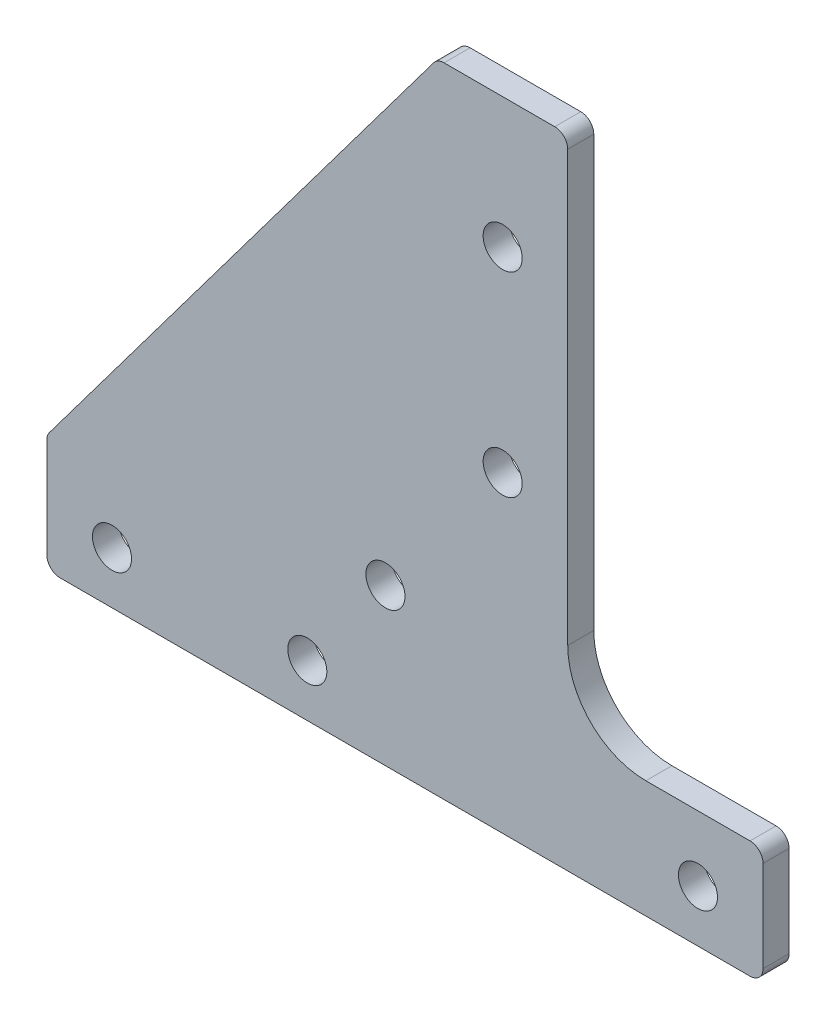
ISO-10303-21;
HEADER;
FILE_DESCRIPTION(('STEP AP214'),'2;1');
FILE_NAME('part.step','',(''),(''),'','','');
FILE_SCHEMA(('AUTOMOTIVE_DESIGN { 1 0 10303 214 1 1 1 1 }'));
ENDSEC;
DATA;
#1=APPLICATION_CONTEXT('core data for automotive mechanical design processes');
#2=APPLICATION_PROTOCOL_DEFINITION('international standard','automotive_design',2000,#1);
#3=PRODUCT_CONTEXT('',#1,'mechanical');
#4=PRODUCT('Part','Part','',(#3));
#5=PRODUCT_RELATED_PRODUCT_CATEGORY('part','',(#4));
#6=PRODUCT_DEFINITION_FORMATION('','',#4);
#7=PRODUCT_DEFINITION_CONTEXT('part definition',#1,'design');
#8=PRODUCT_DEFINITION('design','',#6,#7);
#9=PRODUCT_DEFINITION_SHAPE('','',#8);
#10=(LENGTH_UNIT() NAMED_UNIT(*) SI_UNIT(.MILLI.,.METRE.));
#11=(NAMED_UNIT(*) PLANE_ANGLE_UNIT() SI_UNIT($,.RADIAN.));
#12=(NAMED_UNIT(*) SI_UNIT($,.STERADIAN.) SOLID_ANGLE_UNIT());
#13=UNCERTAINTY_MEASURE_WITH_UNIT(LENGTH_MEASURE(1.E-05),#10,'distance_accuracy_value','');
#14=(GEOMETRIC_REPRESENTATION_CONTEXT(3) GLOBAL_UNCERTAINTY_ASSIGNED_CONTEXT((#13)) GLOBAL_UNIT_ASSIGNED_CONTEXT((#10,
#11,#12)) REPRESENTATION_CONTEXT('',''));
#15=CARTESIAN_POINT('',(0.,0.,0.));
#16=DIRECTION('',(0.,0.,1.));
#17=DIRECTION('',(1.,0.,0.));
#18=AXIS2_PLACEMENT_3D('',#15,#16,#17);
#19=CARTESIAN_POINT('',(20.,0.,2.));
#20=DIRECTION('',(1.,0.,0.));
#21=DIRECTION('',(0.,0.,-1.));
#22=AXIS2_PLACEMENT_3D('',#19,#20,#21);
#23=PLANE('',#22);
#24=DIRECTION('',(0.,-1.,0.));
#25=VECTOR('',#24,1.);
#26=CARTESIAN_POINT('',(20.,0.,0.));
#27=LINE('',#26,#25);
#28=CARTESIAN_POINT('',(20.,4.,0.));
#29=VERTEX_POINT('',#28);
#30=CARTESIAN_POINT('',(20.,-3.,0.));
#31=VERTEX_POINT('',#30);
#32=EDGE_CURVE('E225',#29,#31,#27,.T.);
#33=ORIENTED_EDGE('',*,*,#32,.F.);
#34=DIRECTION('',(0.,0.,-1.));
#35=VECTOR('',#34,1.);
#36=CARTESIAN_POINT('',(20.,4.,2.));
#37=LINE('',#36,#35);
#38=CARTESIAN_POINT('',(20.,4.,2.));
#39=VERTEX_POINT('',#38);
#40=EDGE_CURVE('E63',#29,#39,#37,.F.);
#41=ORIENTED_EDGE('',*,*,#40,.T.);
#42=DIRECTION('',(0.,-1.,0.));
#43=VECTOR('',#42,1.);
#44=CARTESIAN_POINT('',(20.,0.,2.));
#45=LINE('',#44,#43);
#46=CARTESIAN_POINT('',(20.,-3.,2.));
#47=VERTEX_POINT('',#46);
#48=EDGE_CURVE('E194',#39,#47,#45,.T.);
#49=ORIENTED_EDGE('',*,*,#48,.T.);
#50=DIRECTION('',(0.,0.,-1.));
#51=VECTOR('',#50,1.);
#52=CARTESIAN_POINT('',(20.,-3.,0.));
#53=LINE('',#52,#51);
#54=EDGE_CURVE('E281',#47,#31,#53,.T.);
#55=ORIENTED_EDGE('',*,*,#54,.T.);
#56=EDGE_LOOP('',(#33,#41,#49,#55));
#57=FACE_BOUND('',#56,.T.);
#58=ADVANCED_FACE('F41',(#57),#23,.T.);
#59=CARTESIAN_POINT('',(0.,44.9999999999999,2.));
#60=DIRECTION('',(0.,1.,0.));
#61=DIRECTION('',(0.,0.,1.));
#62=AXIS2_PLACEMENT_3D('',#59,#60,#61);
#63=PLANE('',#62);
#64=DIRECTION('',(1.,0.,0.));
#65=VECTOR('',#64,1.);
#66=CARTESIAN_POINT('',(0.,44.9999999999999,0.));
#67=LINE('',#66,#65);
#68=CARTESIAN_POINT('',(-4.50000000000001,44.9999999999999,0.));
#69=VERTEX_POINT('',#68);
#70=CARTESIAN_POINT('',(4.,44.9999999999999,0.));
#71=VERTEX_POINT('',#70);
#72=EDGE_CURVE('E228',#69,#71,#67,.T.);
#73=ORIENTED_EDGE('',*,*,#72,.F.);
#74=DIRECTION('',(0.,0.,-1.));
#75=VECTOR('',#74,1.);
#76=CARTESIAN_POINT('',(-4.50000000000001,44.9999999999999,2.));
#77=LINE('',#76,#75);
#78=CARTESIAN_POINT('',(-4.50000000000001,44.9999999999999,2.));
#79=VERTEX_POINT('',#78);
#80=EDGE_CURVE('E264',#69,#79,#77,.F.);
#81=ORIENTED_EDGE('',*,*,#80,.T.);
#82=DIRECTION('',(1.,0.,0.));
#83=VECTOR('',#82,1.);
#84=CARTESIAN_POINT('',(0.,44.9999999999999,2.));
#85=LINE('',#84,#83);
#86=CARTESIAN_POINT('',(4.,44.9999999999999,2.));
#87=VERTEX_POINT('',#86);
#88=EDGE_CURVE('E196',#79,#87,#85,.T.);
#89=ORIENTED_EDGE('',*,*,#88,.T.);
#90=DIRECTION('',(0.,0.,-1.));
#91=VECTOR('',#90,1.);
#92=CARTESIAN_POINT('',(4.,44.9999999999999,0.));
#93=LINE('',#92,#91);
#94=EDGE_CURVE('E261',#87,#71,#93,.T.);
#95=ORIENTED_EDGE('',*,*,#94,.T.);
#96=EDGE_LOOP('',(#73,#81,#89,#95));
#97=FACE_BOUND('',#96,.T.);
#98=ADVANCED_FACE('F322',(#97),#63,.T.);
#99=CARTESIAN_POINT('',(-24.8,18.6,2.));
#100=DIRECTION('',(-0.799999999999999,0.600000000000001,0.));
#101=DIRECTION('',(-0.600000000000001,-0.799999999999999,0.));
#102=AXIS2_PLACEMENT_3D('',#99,#100,#101);
#103=PLANE('',#102);
#104=DIRECTION('',(0.600000000000001,0.799999999999999,0.));
#105=VECTOR('',#104,1.);
#106=CARTESIAN_POINT('',(-24.8,18.6,2.));
#107=LINE('',#106,#105);
#108=CARTESIAN_POINT('',(-34.8,5.26666666666668,2.));
#109=VERTEX_POINT('',#108);
#110=CARTESIAN_POINT('',(-5.3,44.5999999999999,2.));
#111=VERTEX_POINT('',#110);
#112=EDGE_CURVE('E199',#109,#111,#107,.T.);
#113=ORIENTED_EDGE('',*,*,#112,.T.);
#114=DIRECTION('',(0.,0.,-1.));
#115=VECTOR('',#114,1.);
#116=CARTESIAN_POINT('',(-5.3,44.5999999999999,2.));
#117=LINE('',#116,#115);
#118=CARTESIAN_POINT('',(-5.3,44.5999999999999,0.));
#119=VERTEX_POINT('',#118);
#120=EDGE_CURVE('E246',#111,#119,#117,.T.);
#121=ORIENTED_EDGE('',*,*,#120,.T.);
#122=DIRECTION('',(0.600000000000001,0.799999999999999,0.));
#123=VECTOR('',#122,1.);
#124=CARTESIAN_POINT('',(-24.8,18.6,0.));
#125=LINE('',#124,#123);
#126=CARTESIAN_POINT('',(-34.8,5.26666666666668,0.));
#127=VERTEX_POINT('',#126);
#128=EDGE_CURVE('E231',#127,#119,#125,.T.);
#129=ORIENTED_EDGE('',*,*,#128,.F.);
#130=DIRECTION('',(0.,0.,-1.));
#131=VECTOR('',#130,1.);
#132=CARTESIAN_POINT('',(-34.8,5.26666666666668,2.));
#133=LINE('',#132,#131);
#134=EDGE_CURVE('E244',#127,#109,#133,.F.);
#135=ORIENTED_EDGE('',*,*,#134,.T.);
#136=EDGE_LOOP('',(#113,#121,#129,#135));
#137=FACE_BOUND('',#136,.T.);
#138=ADVANCED_FACE('F328',(#137),#103,.T.);
#139=CARTESIAN_POINT('',(-35.,0.,2.));
#140=DIRECTION('',(-1.,0.,0.));
#141=DIRECTION('',(0.,0.,1.));
#142=AXIS2_PLACEMENT_3D('',#139,#140,#141);
#143=PLANE('',#142);
#144=DIRECTION('',(0.,1.,0.));
#145=VECTOR('',#144,1.);
#146=CARTESIAN_POINT('',(-35.,0.,2.));
#147=LINE('',#146,#145);
#148=CARTESIAN_POINT('',(-35.,-3.,2.));
#149=VERTEX_POINT('',#148);
#150=CARTESIAN_POINT('',(-35.,4.66666666666668,2.));
#151=VERTEX_POINT('',#150);
#152=EDGE_CURVE('E202',#149,#151,#147,.T.);
#153=ORIENTED_EDGE('',*,*,#152,.T.);
#154=DIRECTION('',(0.,0.,-1.));
#155=VECTOR('',#154,1.);
#156=CARTESIAN_POINT('',(-35.,4.66666666666668,2.));
#157=LINE('',#156,#155);
#158=CARTESIAN_POINT('',(-35.,4.66666666666668,0.));
#159=VERTEX_POINT('',#158);
#160=EDGE_CURVE('E11',#151,#159,#157,.T.);
#161=ORIENTED_EDGE('',*,*,#160,.T.);
#162=DIRECTION('',(0.,1.,0.));
#163=VECTOR('',#162,1.);
#164=CARTESIAN_POINT('',(-35.,0.,0.));
#165=LINE('',#164,#163);
#166=CARTESIAN_POINT('',(-35.,-3.,0.));
#167=VERTEX_POINT('',#166);
#168=EDGE_CURVE('E234',#167,#159,#165,.T.);
#169=ORIENTED_EDGE('',*,*,#168,.F.);
#170=DIRECTION('',(0.,0.,-1.));
#171=VECTOR('',#170,1.);
#172=CARTESIAN_POINT('',(-35.,-3.,2.));
#173=LINE('',#172,#171);
#174=EDGE_CURVE('E49',#167,#149,#173,.F.);
#175=ORIENTED_EDGE('',*,*,#174,.T.);
#176=EDGE_LOOP('',(#153,#161,#169,#175));
#177=FACE_BOUND('',#176,.T.);
#178=ADVANCED_FACE('F293',(#177),#143,.T.);
#179=CARTESIAN_POINT('',(-30.,0.,2.));
#180=DIRECTION('',(0.,0.,-1.));
#181=DIRECTION('',(-1.,0.,0.));
#182=AXIS2_PLACEMENT_3D('',#179,#180,#181);
#183=CYLINDRICAL_SURFACE('',#182,1.5);
#184=CARTESIAN_POINT('',(-30.,0.,2.));
#185=DIRECTION('',(0.,0.,1.));
#186=DIRECTION('',(1.,0.,0.));
#187=AXIS2_PLACEMENT_3D('',#184,#185,#186);
#188=CIRCLE('',#187,1.5);
#189=CARTESIAN_POINT('',(-28.5,0.,2.));
#190=VERTEX_POINT('',#189);
#191=EDGE_CURVE('E191',#190,#190,#188,.T.);
#192=ORIENTED_EDGE('',*,*,#191,.T.);
#193=EDGE_LOOP('',(#192));
#194=FACE_BOUND('',#193,.T.);
#195=CARTESIAN_POINT('',(-30.,0.,0.));
#196=DIRECTION('',(0.,0.,1.));
#197=DIRECTION('',(1.,0.,0.));
#198=AXIS2_PLACEMENT_3D('',#195,#196,#197);
#199=CIRCLE('',#198,1.5);
#200=CARTESIAN_POINT('',(-28.5,0.,0.));
#201=VERTEX_POINT('',#200);
#202=EDGE_CURVE('E222',#201,#201,#199,.T.);
#203=ORIENTED_EDGE('',*,*,#202,.F.);
#204=EDGE_LOOP('',(#203));
#205=FACE_BOUND('',#204,.T.);
#206=ADVANCED_FACE('F347',(#194,#205),#183,.F.);
#207=CARTESIAN_POINT('',(0.,35.,2.));
#208=DIRECTION('',(0.,0.,-1.));
#209=DIRECTION('',(-1.,0.,0.));
#210=AXIS2_PLACEMENT_3D('',#207,#208,#209);
#211=CYLINDRICAL_SURFACE('',#210,1.5);
#212=CARTESIAN_POINT('',(0.,35.,2.));
#213=DIRECTION('',(0.,0.,1.));
#214=DIRECTION('',(1.,0.,0.));
#215=AXIS2_PLACEMENT_3D('',#212,#213,#214);
#216=CIRCLE('',#215,1.5);
#217=CARTESIAN_POINT('',(1.5,35.,2.));
#218=VERTEX_POINT('',#217);
#219=EDGE_CURVE('E188',#218,#218,#216,.T.);
#220=ORIENTED_EDGE('',*,*,#219,.T.);
#221=EDGE_LOOP('',(#220));
#222=FACE_BOUND('',#221,.T.);
#223=CARTESIAN_POINT('',(0.,35.,0.));
#224=DIRECTION('',(0.,0.,1.));
#225=DIRECTION('',(1.,0.,0.));
#226=AXIS2_PLACEMENT_3D('',#223,#224,#225);
#227=CIRCLE('',#226,1.5);
#228=CARTESIAN_POINT('',(1.5,35.,0.));
#229=VERTEX_POINT('',#228);
#230=EDGE_CURVE('E219',#229,#229,#227,.T.);
#231=ORIENTED_EDGE('',*,*,#230,.F.);
#232=EDGE_LOOP('',(#231));
#233=FACE_BOUND('',#232,.T.);
#234=ADVANCED_FACE('F350',(#222,#233),#211,.F.);
#235=CARTESIAN_POINT('',(-15.,0.,2.));
#236=DIRECTION('',(0.,0.,-1.));
#237=DIRECTION('',(-1.,0.,0.));
#238=AXIS2_PLACEMENT_3D('',#235,#236,#237);
#239=CYLINDRICAL_SURFACE('',#238,1.5);
#240=CARTESIAN_POINT('',(-15.,0.,2.));
#241=DIRECTION('',(0.,0.,1.));
#242=DIRECTION('',(1.,0.,0.));
#243=AXIS2_PLACEMENT_3D('',#240,#241,#242);
#244=CIRCLE('',#243,1.5);
#245=CARTESIAN_POINT('',(-13.5,0.,2.));
#246=VERTEX_POINT('',#245);
#247=EDGE_CURVE('E185',#246,#246,#244,.T.);
#248=ORIENTED_EDGE('',*,*,#247,.T.);
#249=EDGE_LOOP('',(#248));
#250=FACE_BOUND('',#249,.T.);
#251=CARTESIAN_POINT('',(-15.,0.,0.));
#252=DIRECTION('',(0.,0.,1.));
#253=DIRECTION('',(1.,0.,0.));
#254=AXIS2_PLACEMENT_3D('',#251,#252,#253);
#255=CIRCLE('',#254,1.5);
#256=CARTESIAN_POINT('',(-13.5,0.,0.));
#257=VERTEX_POINT('',#256);
#258=EDGE_CURVE('E216',#257,#257,#255,.T.);
#259=ORIENTED_EDGE('',*,*,#258,.F.);
#260=EDGE_LOOP('',(#259));
#261=FACE_BOUND('',#260,.T.);
#262=ADVANCED_FACE('F354',(#250,#261),#239,.F.);
#263=CARTESIAN_POINT('',(0.,20.,2.));
#264=DIRECTION('',(0.,0.,-1.));
#265=DIRECTION('',(-1.,0.,0.));
#266=AXIS2_PLACEMENT_3D('',#263,#264,#265);
#267=CYLINDRICAL_SURFACE('',#266,1.5);
#268=CARTESIAN_POINT('',(0.,20.,2.));
#269=DIRECTION('',(0.,0.,1.));
#270=DIRECTION('',(1.,0.,0.));
#271=AXIS2_PLACEMENT_3D('',#268,#269,#270);
#272=CIRCLE('',#271,1.5);
#273=CARTESIAN_POINT('',(1.5,20.,2.));
#274=VERTEX_POINT('',#273);
#275=EDGE_CURVE('E182',#274,#274,#272,.T.);
#276=ORIENTED_EDGE('',*,*,#275,.T.);
#277=EDGE_LOOP('',(#276));
#278=FACE_BOUND('',#277,.T.);
#279=CARTESIAN_POINT('',(0.,20.,0.));
#280=DIRECTION('',(0.,0.,1.));
#281=DIRECTION('',(1.,0.,0.));
#282=AXIS2_PLACEMENT_3D('',#279,#280,#281);
#283=CIRCLE('',#282,1.5);
#284=CARTESIAN_POINT('',(1.5,20.,0.));
#285=VERTEX_POINT('',#284);
#286=EDGE_CURVE('E213',#285,#285,#283,.T.);
#287=ORIENTED_EDGE('',*,*,#286,.F.);
#288=EDGE_LOOP('',(#287));
#289=FACE_BOUND('',#288,.T.);
#290=ADVANCED_FACE('F358',(#278,#289),#267,.F.);
#291=CARTESIAN_POINT('',(-8.99999999999999,8.00000000000001,2.));
#292=DIRECTION('',(0.,0.,-1.));
#293=DIRECTION('',(-1.,0.,0.));
#294=AXIS2_PLACEMENT_3D('',#291,#292,#293);
#295=CYLINDRICAL_SURFACE('',#294,1.5);
#296=CARTESIAN_POINT('',(-8.99999999999999,8.00000000000001,2.));
#297=DIRECTION('',(0.,0.,1.));
#298=DIRECTION('',(1.,0.,0.));
#299=AXIS2_PLACEMENT_3D('',#296,#297,#298);
#300=CIRCLE('',#299,1.5);
#301=CARTESIAN_POINT('',(-7.49999999999999,8.00000000000001,2.));
#302=VERTEX_POINT('',#301);
#303=EDGE_CURVE('E178',#302,#302,#300,.T.);
#304=ORIENTED_EDGE('',*,*,#303,.T.);
#305=EDGE_LOOP('',(#304));
#306=FACE_BOUND('',#305,.T.);
#307=CARTESIAN_POINT('',(-8.99999999999999,8.00000000000001,0.));
#308=DIRECTION('',(0.,0.,1.));
#309=DIRECTION('',(1.,0.,0.));
#310=AXIS2_PLACEMENT_3D('',#307,#308,#309);
#311=CIRCLE('',#310,1.5);
#312=CARTESIAN_POINT('',(-7.49999999999999,8.00000000000001,0.));
#313=VERTEX_POINT('',#312);
#314=EDGE_CURVE('E210',#313,#313,#311,.T.);
#315=ORIENTED_EDGE('',*,*,#314,.F.);
#316=EDGE_LOOP('',(#315));
#317=FACE_BOUND('',#316,.T.);
#318=ADVANCED_FACE('F362',(#306,#317),#295,.F.);
#319=CARTESIAN_POINT('',(15.,0.,2.));
#320=DIRECTION('',(0.,0.,-1.));
#321=DIRECTION('',(-1.,0.,0.));
#322=AXIS2_PLACEMENT_3D('',#319,#320,#321);
#323=CYLINDRICAL_SURFACE('',#322,1.5);
#324=CARTESIAN_POINT('',(15.,0.,2.));
#325=DIRECTION('',(0.,0.,1.));
#326=DIRECTION('',(1.,0.,0.));
#327=AXIS2_PLACEMENT_3D('',#324,#325,#326);
#328=CIRCLE('',#327,1.5);
#329=CARTESIAN_POINT('',(16.5,0.,2.));
#330=VERTEX_POINT('',#329);
#331=EDGE_CURVE('E175',#330,#330,#328,.T.);
#332=ORIENTED_EDGE('',*,*,#331,.T.);
#333=EDGE_LOOP('',(#332));
#334=FACE_BOUND('',#333,.T.);
#335=CARTESIAN_POINT('',(15.,0.,0.));
#336=DIRECTION('',(0.,0.,1.));
#337=DIRECTION('',(1.,0.,0.));
#338=AXIS2_PLACEMENT_3D('',#335,#336,#337);
#339=CIRCLE('',#338,1.5);
#340=CARTESIAN_POINT('',(16.5,0.,0.));
#341=VERTEX_POINT('',#340);
#342=EDGE_CURVE('E173',#341,#341,#339,.T.);
#343=ORIENTED_EDGE('',*,*,#342,.F.);
#344=EDGE_LOOP('',(#343));
#345=FACE_BOUND('',#344,.T.);
#346=ADVANCED_FACE('F366',(#334,#345),#323,.F.);
#347=CARTESIAN_POINT('',(0.,-4.,2.));
#348=DIRECTION('',(0.,1.,0.));
#349=DIRECTION('',(-1.,0.,0.));
#350=AXIS2_PLACEMENT_3D('',#347,#348,#349);
#351=PLANE('',#350);
#352=DIRECTION('',(1.,0.,0.));
#353=VECTOR('',#352,1.);
#354=CARTESIAN_POINT('',(0.,-4.,0.));
#355=LINE('',#354,#353);
#356=CARTESIAN_POINT('',(-34.,-4.,0.));
#357=VERTEX_POINT('',#356);
#358=CARTESIAN_POINT('',(19.,-4.,0.));
#359=VERTEX_POINT('',#358);
#360=EDGE_CURVE('E179',#357,#359,#355,.T.);
#361=ORIENTED_EDGE('',*,*,#360,.T.);
#362=DIRECTION('',(0.,0.,-1.));
#363=VECTOR('',#362,1.);
#364=CARTESIAN_POINT('',(19.,-4.,2.));
#365=LINE('',#364,#363);
#366=CARTESIAN_POINT('',(19.,-4.,2.));
#367=VERTEX_POINT('',#366);
#368=EDGE_CURVE('E288',#359,#367,#365,.F.);
#369=ORIENTED_EDGE('',*,*,#368,.T.);
#370=DIRECTION('',(1.,0.,0.));
#371=VECTOR('',#370,1.);
#372=CARTESIAN_POINT('',(0.,-4.,2.));
#373=LINE('',#372,#371);
#374=CARTESIAN_POINT('',(-34.,-4.,2.));
#375=VERTEX_POINT('',#374);
#376=EDGE_CURVE('E205',#375,#367,#373,.T.);
#377=ORIENTED_EDGE('',*,*,#376,.F.);
#378=DIRECTION('',(0.,0.,-1.));
#379=VECTOR('',#378,1.);
#380=CARTESIAN_POINT('',(-34.,-4.,0.));
#381=LINE('',#380,#379);
#382=EDGE_CURVE('E285',#375,#357,#381,.T.);
#383=ORIENTED_EDGE('',*,*,#382,.T.);
#384=EDGE_LOOP('',(#361,#369,#377,#383));
#385=FACE_BOUND('',#384,.T.);
#386=ADVANCED_FACE('F303',(#385),#351,.F.);
#387=CARTESIAN_POINT('',(0.,0.,2.));
#388=DIRECTION('',(0.,0.,1.));
#389=DIRECTION('',(1.,0.,0.));
#390=AXIS2_PLACEMENT_3D('',#387,#388,#389);
#391=PLANE('',#390);
#392=ORIENTED_EDGE('',*,*,#88,.F.);
#393=CARTESIAN_POINT('',(-4.50000000000001,43.9999999999999,2.));
#394=DIRECTION('',(0.,0.,1.));
#395=DIRECTION('',(1.,0.,0.));
#396=AXIS2_PLACEMENT_3D('',#393,#394,#395);
#397=CIRCLE('',#396,1.);
#398=EDGE_CURVE('E275',#79,#111,#397,.T.);
#399=ORIENTED_EDGE('',*,*,#398,.T.);
#400=ORIENTED_EDGE('',*,*,#112,.F.);
#401=CARTESIAN_POINT('',(-34.,4.66666666666668,2.));
#402=DIRECTION('',(0.,0.,1.));
#403=DIRECTION('',(1.,0.,0.));
#404=AXIS2_PLACEMENT_3D('',#401,#402,#403);
#405=CIRCLE('',#404,1.);
#406=EDGE_CURVE('E268',#109,#151,#405,.T.);
#407=ORIENTED_EDGE('',*,*,#406,.T.);
#408=ORIENTED_EDGE('',*,*,#152,.F.);
#409=CARTESIAN_POINT('',(-34.,-3.,2.));
#410=DIRECTION('',(0.,0.,1.));
#411=DIRECTION('',(1.,0.,0.));
#412=AXIS2_PLACEMENT_3D('',#409,#410,#411);
#413=CIRCLE('',#412,1.);
#414=EDGE_CURVE('E266',#149,#375,#413,.T.);
#415=ORIENTED_EDGE('',*,*,#414,.T.);
#416=ORIENTED_EDGE('',*,*,#376,.T.);
#417=CARTESIAN_POINT('',(19.,-3.,2.));
#418=DIRECTION('',(0.,0.,1.));
#419=DIRECTION('',(1.,0.,0.));
#420=AXIS2_PLACEMENT_3D('',#417,#418,#419);
#421=CIRCLE('',#420,1.);
#422=EDGE_CURVE('E56',#367,#47,#421,.T.);
#423=ORIENTED_EDGE('',*,*,#422,.T.);
#424=ORIENTED_EDGE('',*,*,#48,.F.);
#425=CARTESIAN_POINT('',(19.,4.,2.));
#426=DIRECTION('',(0.,0.,1.));
#427=DIRECTION('',(1.,0.,0.));
#428=AXIS2_PLACEMENT_3D('',#425,#426,#427);
#429=CIRCLE('',#428,1.);
#430=CARTESIAN_POINT('',(19.,5.,2.));
#431=VERTEX_POINT('',#430);
#432=EDGE_CURVE('E271',#39,#431,#429,.T.);
#433=ORIENTED_EDGE('',*,*,#432,.T.);
#434=DIRECTION('',(1.,0.,0.));
#435=VECTOR('',#434,1.);
#436=CARTESIAN_POINT('',(11.,5.00000000000001,2.));
#437=LINE('',#436,#435);
#438=CARTESIAN_POINT('',(11.,5.00000000000001,2.));
#439=VERTEX_POINT('',#438);
#440=EDGE_CURVE('E164',#439,#431,#437,.T.);
#441=ORIENTED_EDGE('',*,*,#440,.F.);
#442=CARTESIAN_POINT('',(11.,11.,2.));
#443=DIRECTION('',(0.,0.,1.));
#444=DIRECTION('',(-1.,0.,0.));
#445=AXIS2_PLACEMENT_3D('',#442,#443,#444);
#446=CIRCLE('',#445,6.);
#447=CARTESIAN_POINT('',(5.00000000000001,11.,2.));
#448=VERTEX_POINT('',#447);
#449=EDGE_CURVE('E154',#448,#439,#446,.T.);
#450=ORIENTED_EDGE('',*,*,#449,.F.);
#451=DIRECTION('',(0.,-1.,0.));
#452=VECTOR('',#451,1.);
#453=CARTESIAN_POINT('',(5.,44.9999999999999,2.));
#454=LINE('',#453,#452);
#455=CARTESIAN_POINT('',(5.,43.9999999999999,2.));
#456=VERTEX_POINT('',#455);
#457=EDGE_CURVE('E144',#456,#448,#454,.T.);
#458=ORIENTED_EDGE('',*,*,#457,.F.);
#459=CARTESIAN_POINT('',(4.,43.9999999999999,2.));
#460=DIRECTION('',(0.,0.,1.));
#461=DIRECTION('',(1.,0.,0.));
#462=AXIS2_PLACEMENT_3D('',#459,#460,#461);
#463=CIRCLE('',#462,1.);
#464=EDGE_CURVE('E273',#456,#87,#463,.T.);
#465=ORIENTED_EDGE('',*,*,#464,.T.);
#466=EDGE_LOOP('',(#392,#399,#400,#407,#408,#415,#416,#423,#424,#433,#441,#450,#458,#465));
#467=FACE_BOUND('',#466,.T.);
#468=ORIENTED_EDGE('',*,*,#331,.F.);
#469=EDGE_LOOP('',(#468));
#470=FACE_BOUND('',#469,.T.);
#471=ORIENTED_EDGE('',*,*,#303,.F.);
#472=EDGE_LOOP('',(#471));
#473=FACE_BOUND('',#472,.T.);
#474=ORIENTED_EDGE('',*,*,#275,.F.);
#475=EDGE_LOOP('',(#474));
#476=FACE_BOUND('',#475,.T.);
#477=ORIENTED_EDGE('',*,*,#247,.F.);
#478=EDGE_LOOP('',(#477));
#479=FACE_BOUND('',#478,.T.);
#480=ORIENTED_EDGE('',*,*,#219,.F.);
#481=EDGE_LOOP('',(#480));
#482=FACE_BOUND('',#481,.T.);
#483=ORIENTED_EDGE('',*,*,#191,.F.);
#484=EDGE_LOOP('',(#483));
#485=FACE_BOUND('',#484,.T.);
#486=ADVANCED_FACE('F167',(#467,#470,#473,#476,#479,#482,#485),#391,.T.);
#487=CARTESIAN_POINT('',(0.,0.,0.));
#488=DIRECTION('',(0.,0.,1.));
#489=DIRECTION('',(1.,0.,0.));
#490=AXIS2_PLACEMENT_3D('',#487,#488,#489);
#491=PLANE('',#490);
#492=ORIENTED_EDGE('',*,*,#342,.T.);
#493=EDGE_LOOP('',(#492));
#494=FACE_BOUND('',#493,.T.);
#495=ORIENTED_EDGE('',*,*,#314,.T.);
#496=EDGE_LOOP('',(#495));
#497=FACE_BOUND('',#496,.T.);
#498=ORIENTED_EDGE('',*,*,#286,.T.);
#499=EDGE_LOOP('',(#498));
#500=FACE_BOUND('',#499,.T.);
#501=ORIENTED_EDGE('',*,*,#258,.T.);
#502=EDGE_LOOP('',(#501));
#503=FACE_BOUND('',#502,.T.);
#504=ORIENTED_EDGE('',*,*,#230,.T.);
#505=EDGE_LOOP('',(#504));
#506=FACE_BOUND('',#505,.T.);
#507=ORIENTED_EDGE('',*,*,#202,.T.);
#508=EDGE_LOOP('',(#507));
#509=FACE_BOUND('',#508,.T.);
#510=ORIENTED_EDGE('',*,*,#128,.T.);
#511=CARTESIAN_POINT('',(-4.50000000000001,43.9999999999999,0.));
#512=DIRECTION('',(0.,0.,1.));
#513=DIRECTION('',(1.,0.,0.));
#514=AXIS2_PLACEMENT_3D('',#511,#512,#513);
#515=CIRCLE('',#514,1.);
#516=EDGE_CURVE('E259',#119,#69,#515,.F.);
#517=ORIENTED_EDGE('',*,*,#516,.T.);
#518=ORIENTED_EDGE('',*,*,#72,.T.);
#519=CARTESIAN_POINT('',(4.,43.9999999999999,0.));
#520=DIRECTION('',(0.,0.,1.));
#521=DIRECTION('',(1.,0.,0.));
#522=AXIS2_PLACEMENT_3D('',#519,#520,#521);
#523=CIRCLE('',#522,1.);
#524=CARTESIAN_POINT('',(5.,43.9999999999999,0.));
#525=VERTEX_POINT('',#524);
#526=EDGE_CURVE('E257',#71,#525,#523,.F.);
#527=ORIENTED_EDGE('',*,*,#526,.T.);
#528=DIRECTION('',(0.,-1.,0.));
#529=VECTOR('',#528,1.);
#530=CARTESIAN_POINT('',(5.00000000000001,0.,0.));
#531=LINE('',#530,#529);
#532=CARTESIAN_POINT('',(5.00000000000001,11.,0.));
#533=VERTEX_POINT('',#532);
#534=EDGE_CURVE('E207',#525,#533,#531,.T.);
#535=ORIENTED_EDGE('',*,*,#534,.T.);
#536=CARTESIAN_POINT('',(11.,11.,0.));
#537=DIRECTION('',(0.,0.,1.));
#538=DIRECTION('',(1.,0.,0.));
#539=AXIS2_PLACEMENT_3D('',#536,#537,#538);
#540=CIRCLE('',#539,6.);
#541=CARTESIAN_POINT('',(11.,5.00000000000001,0.));
#542=VERTEX_POINT('',#541);
#543=EDGE_CURVE('E162',#533,#542,#540,.T.);
#544=ORIENTED_EDGE('',*,*,#543,.T.);
#545=DIRECTION('',(1.,0.,0.));
#546=VECTOR('',#545,1.);
#547=CARTESIAN_POINT('',(0.,5.00000000000002,0.));
#548=LINE('',#547,#546);
#549=CARTESIAN_POINT('',(19.,5.,0.));
#550=VERTEX_POINT('',#549);
#551=EDGE_CURVE('E241',#542,#550,#548,.T.);
#552=ORIENTED_EDGE('',*,*,#551,.T.);
#553=CARTESIAN_POINT('',(19.,4.,0.));
#554=DIRECTION('',(0.,0.,1.));
#555=DIRECTION('',(1.,0.,0.));
#556=AXIS2_PLACEMENT_3D('',#553,#554,#555);
#557=CIRCLE('',#556,1.);
#558=EDGE_CURVE('E255',#550,#29,#557,.F.);
#559=ORIENTED_EDGE('',*,*,#558,.T.);
#560=ORIENTED_EDGE('',*,*,#32,.T.);
#561=CARTESIAN_POINT('',(19.,-3.,0.));
#562=DIRECTION('',(0.,0.,1.));
#563=DIRECTION('',(1.,0.,0.));
#564=AXIS2_PLACEMENT_3D('',#561,#562,#563);
#565=CIRCLE('',#564,1.);
#566=EDGE_CURVE('E253',#31,#359,#565,.F.);
#567=ORIENTED_EDGE('',*,*,#566,.T.);
#568=ORIENTED_EDGE('',*,*,#360,.F.);
#569=CARTESIAN_POINT('',(-34.,-3.,0.));
#570=DIRECTION('',(0.,0.,1.));
#571=DIRECTION('',(1.,0.,0.));
#572=AXIS2_PLACEMENT_3D('',#569,#570,#571);
#573=CIRCLE('',#572,1.);
#574=EDGE_CURVE('E249',#357,#167,#573,.F.);
#575=ORIENTED_EDGE('',*,*,#574,.T.);
#576=ORIENTED_EDGE('',*,*,#168,.T.);
#577=CARTESIAN_POINT('',(-34.,4.66666666666668,0.));
#578=DIRECTION('',(0.,0.,1.));
#579=DIRECTION('',(1.,0.,0.));
#580=AXIS2_PLACEMENT_3D('',#577,#578,#579);
#581=CIRCLE('',#580,1.);
#582=EDGE_CURVE('E251',#159,#127,#581,.F.);
#583=ORIENTED_EDGE('',*,*,#582,.T.);
#584=EDGE_LOOP('',(#510,#517,#518,#527,#535,#544,#552,#559,#560,#567,#568,#575,#576,#583));
#585=FACE_BOUND('',#584,.T.);
#586=ADVANCED_FACE('F306',(#494,#497,#500,#503,#506,#509,#585),#491,.F.);
#587=CARTESIAN_POINT('',(11.,5.00000000000001,-8.));
#588=DIRECTION('',(0.,-1.,0.));
#589=DIRECTION('',(1.,0.,0.));
#590=AXIS2_PLACEMENT_3D('',#587,#588,#589);
#591=PLANE('',#590);
#592=ORIENTED_EDGE('',*,*,#440,.T.);
#593=DIRECTION('',(0.,0.,-1.));
#594=VECTOR('',#593,1.);
#595=CARTESIAN_POINT('',(19.,5.,0.));
#596=LINE('',#595,#594);
#597=EDGE_CURVE('E278',#431,#550,#596,.T.);
#598=ORIENTED_EDGE('',*,*,#597,.T.);
#599=ORIENTED_EDGE('',*,*,#551,.F.);
#600=DIRECTION('',(0.,0.,1.));
#601=VECTOR('',#600,1.);
#602=CARTESIAN_POINT('',(11.,5.00000000000001,-8.));
#603=LINE('',#602,#601);
#604=EDGE_CURVE('E163',#542,#439,#603,.T.);
#605=ORIENTED_EDGE('',*,*,#604,.T.);
#606=EDGE_LOOP('',(#592,#598,#599,#605));
#607=FACE_BOUND('',#606,.T.);
#608=ADVANCED_FACE('F315',(#607),#591,.F.);
#609=CARTESIAN_POINT('',(11.,11.,-8.));
#610=DIRECTION('',(0.,0.,1.));
#611=DIRECTION('',(1.,0.,0.));
#612=AXIS2_PLACEMENT_3D('',#609,#610,#611);
#613=CYLINDRICAL_SURFACE('',#612,6.);
#614=DIRECTION('',(0.,0.,1.));
#615=VECTOR('',#614,1.);
#616=CARTESIAN_POINT('',(5.00000000000001,11.,-8.));
#617=LINE('',#616,#615);
#618=EDGE_CURVE('E148',#533,#448,#617,.T.);
#619=ORIENTED_EDGE('',*,*,#618,.T.);
#620=ORIENTED_EDGE('',*,*,#449,.T.);
#621=ORIENTED_EDGE('',*,*,#604,.F.);
#622=ORIENTED_EDGE('',*,*,#543,.F.);
#623=EDGE_LOOP('',(#619,#620,#621,#622));
#624=FACE_BOUND('',#623,.T.);
#625=ADVANCED_FACE('F158',(#624),#613,.F.);
#626=CARTESIAN_POINT('',(5.,44.9999999999999,-8.));
#627=DIRECTION('',(-1.,0.,0.));
#628=DIRECTION('',(0.,-1.,0.));
#629=AXIS2_PLACEMENT_3D('',#626,#627,#628);
#630=PLANE('',#629);
#631=ORIENTED_EDGE('',*,*,#534,.F.);
#632=DIRECTION('',(0.,0.,-1.));
#633=VECTOR('',#632,1.);
#634=CARTESIAN_POINT('',(5.,43.9999999999999,2.));
#635=LINE('',#634,#633);
#636=EDGE_CURVE('E151',#525,#456,#635,.F.);
#637=ORIENTED_EDGE('',*,*,#636,.T.);
#638=ORIENTED_EDGE('',*,*,#457,.T.);
#639=ORIENTED_EDGE('',*,*,#618,.F.);
#640=EDGE_LOOP('',(#631,#637,#638,#639));
#641=FACE_BOUND('',#640,.T.);
#642=ADVANCED_FACE('F147',(#641),#630,.F.);
#643=CARTESIAN_POINT('',(-4.50000000000001,43.9999999999999,2.));
#644=DIRECTION('',(0.,0.,-1.));
#645=DIRECTION('',(-1.,0.,0.));
#646=AXIS2_PLACEMENT_3D('',#643,#644,#645);
#647=CYLINDRICAL_SURFACE('',#646,1.);
#648=ORIENTED_EDGE('',*,*,#398,.F.);
#649=ORIENTED_EDGE('',*,*,#80,.F.);
#650=ORIENTED_EDGE('',*,*,#516,.F.);
#651=ORIENTED_EDGE('',*,*,#120,.F.);
#652=EDGE_LOOP('',(#648,#649,#650,#651));
#653=FACE_BOUND('',#652,.T.);
#654=ADVANCED_FACE('F325',(#653),#647,.T.);
#655=CARTESIAN_POINT('',(4.,43.9999999999999,2.));
#656=DIRECTION('',(0.,0.,1.));
#657=DIRECTION('',(1.,0.,0.));
#658=AXIS2_PLACEMENT_3D('',#655,#656,#657);
#659=CYLINDRICAL_SURFACE('',#658,1.);
#660=ORIENTED_EDGE('',*,*,#464,.F.);
#661=ORIENTED_EDGE('',*,*,#636,.F.);
#662=ORIENTED_EDGE('',*,*,#526,.F.);
#663=ORIENTED_EDGE('',*,*,#94,.F.);
#664=EDGE_LOOP('',(#660,#661,#662,#663));
#665=FACE_BOUND('',#664,.T.);
#666=ADVANCED_FACE('F317',(#665),#659,.T.);
#667=CARTESIAN_POINT('',(19.,4.,-8.));
#668=DIRECTION('',(0.,0.,1.));
#669=DIRECTION('',(1.,0.,0.));
#670=AXIS2_PLACEMENT_3D('',#667,#668,#669);
#671=CYLINDRICAL_SURFACE('',#670,1.);
#672=ORIENTED_EDGE('',*,*,#432,.F.);
#673=ORIENTED_EDGE('',*,*,#40,.F.);
#674=ORIENTED_EDGE('',*,*,#558,.F.);
#675=ORIENTED_EDGE('',*,*,#597,.F.);
#676=EDGE_LOOP('',(#672,#673,#674,#675));
#677=FACE_BOUND('',#676,.T.);
#678=ADVANCED_FACE('F313',(#677),#671,.T.);
#679=CARTESIAN_POINT('',(19.,-3.,2.));
#680=DIRECTION('',(0.,0.,1.));
#681=DIRECTION('',(1.,0.,0.));
#682=AXIS2_PLACEMENT_3D('',#679,#680,#681);
#683=CYLINDRICAL_SURFACE('',#682,1.);
#684=ORIENTED_EDGE('',*,*,#422,.F.);
#685=ORIENTED_EDGE('',*,*,#368,.F.);
#686=ORIENTED_EDGE('',*,*,#566,.F.);
#687=ORIENTED_EDGE('',*,*,#54,.F.);
#688=EDGE_LOOP('',(#684,#685,#686,#687));
#689=FACE_BOUND('',#688,.T.);
#690=ADVANCED_FACE('F309',(#689),#683,.T.);
#691=CARTESIAN_POINT('',(-34.,4.66666666666668,2.));
#692=DIRECTION('',(0.,0.,-1.));
#693=DIRECTION('',(-1.,0.,0.));
#694=AXIS2_PLACEMENT_3D('',#691,#692,#693);
#695=CYLINDRICAL_SURFACE('',#694,1.);
#696=ORIENTED_EDGE('',*,*,#406,.F.);
#697=ORIENTED_EDGE('',*,*,#134,.F.);
#698=ORIENTED_EDGE('',*,*,#582,.F.);
#699=ORIENTED_EDGE('',*,*,#160,.F.);
#700=EDGE_LOOP('',(#696,#697,#698,#699));
#701=FACE_BOUND('',#700,.T.);
#702=ADVANCED_FACE('F332',(#701),#695,.T.);
#703=CARTESIAN_POINT('',(-34.,-3.,2.));
#704=DIRECTION('',(0.,0.,1.));
#705=DIRECTION('',(1.,0.,0.));
#706=AXIS2_PLACEMENT_3D('',#703,#704,#705);
#707=CYLINDRICAL_SURFACE('',#706,1.);
#708=ORIENTED_EDGE('',*,*,#414,.F.);
#709=ORIENTED_EDGE('',*,*,#174,.F.);
#710=ORIENTED_EDGE('',*,*,#574,.F.);
#711=ORIENTED_EDGE('',*,*,#382,.F.);
#712=EDGE_LOOP('',(#708,#709,#710,#711));
#713=FACE_BOUND('',#712,.T.);
#714=ADVANCED_FACE('F43',(#713),#707,.T.);
#715=CLOSED_SHELL('',(#58,#98,#138,#178,#206,#234,#262,#290,#318,#346,#386,#486,#586,#608,#625,
#642,#654,#666,#678,#690,#702,#714));
#716=MANIFOLD_SOLID_BREP('B2',#715);
#717=ADVANCED_BREP_SHAPE_REPRESENTATION('',(#18,#716),#14);
#718=SHAPE_DEFINITION_REPRESENTATION(#9,#717);
ENDSEC;
END-ISO-10303-21;
